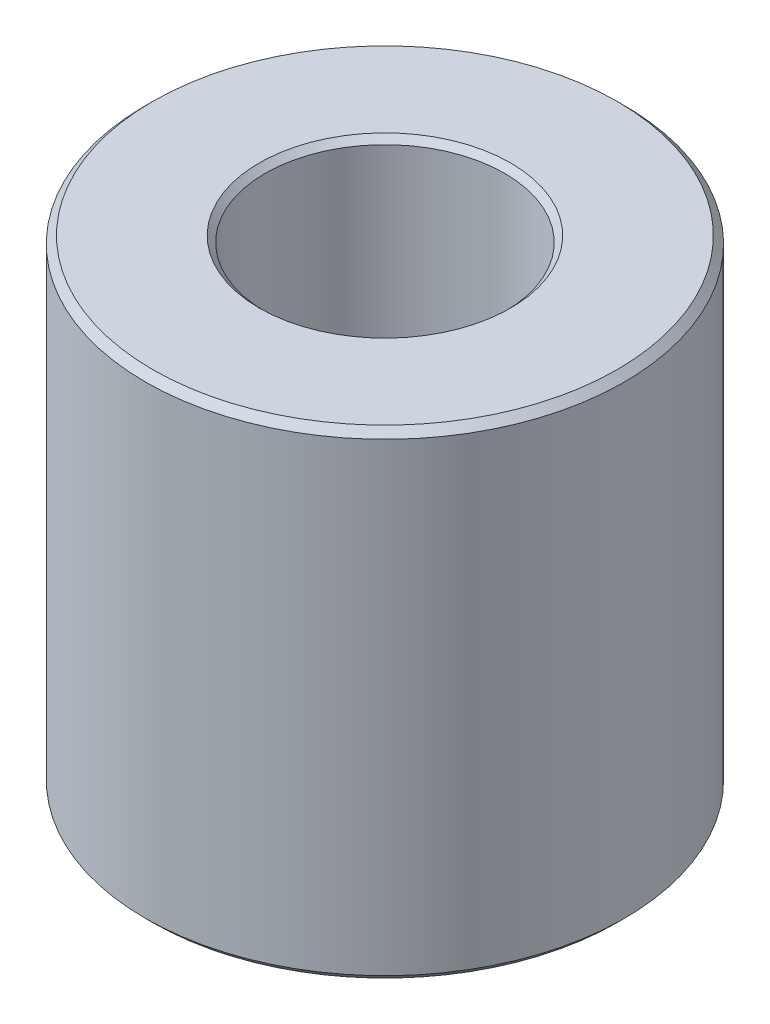
ISO-10303-21;
HEADER;
FILE_DESCRIPTION(('STEP AP214'),'2;1');
FILE_NAME('part.step','',(''),(''),'','','');
FILE_SCHEMA(('AUTOMOTIVE_DESIGN { 1 0 10303 214 1 1 1 1 }'));
ENDSEC;
DATA;
#1=APPLICATION_CONTEXT('core data for automotive mechanical design processes');
#2=APPLICATION_PROTOCOL_DEFINITION('international standard','automotive_design',2000,#1);
#3=PRODUCT_CONTEXT('',#1,'mechanical');
#4=PRODUCT('Part','Part','',(#3));
#5=PRODUCT_RELATED_PRODUCT_CATEGORY('part','',(#4));
#6=PRODUCT_DEFINITION_FORMATION('','',#4);
#7=PRODUCT_DEFINITION_CONTEXT('part definition',#1,'design');
#8=PRODUCT_DEFINITION('design','',#6,#7);
#9=PRODUCT_DEFINITION_SHAPE('','',#8);
#10=(LENGTH_UNIT() NAMED_UNIT(*) SI_UNIT(.MILLI.,.METRE.));
#11=(NAMED_UNIT(*) PLANE_ANGLE_UNIT() SI_UNIT($,.RADIAN.));
#12=(NAMED_UNIT(*) SI_UNIT($,.STERADIAN.) SOLID_ANGLE_UNIT());
#13=UNCERTAINTY_MEASURE_WITH_UNIT(LENGTH_MEASURE(1.E-05),#10,'distance_accuracy_value','');
#14=(GEOMETRIC_REPRESENTATION_CONTEXT(3) GLOBAL_UNCERTAINTY_ASSIGNED_CONTEXT((#13)) GLOBAL_UNIT_ASSIGNED_CONTEXT((#10,
#11,#12)) REPRESENTATION_CONTEXT('',''));
#15=CARTESIAN_POINT('',(0.,0.,0.));
#16=DIRECTION('',(0.,0.,1.));
#17=DIRECTION('',(1.,0.,0.));
#18=AXIS2_PLACEMENT_3D('',#15,#16,#17);
#19=CARTESIAN_POINT('',(0.,50.8,0.));
#20=DIRECTION('',(0.,-1.,0.));
#21=DIRECTION('',(0.,0.,-1.));
#22=AXIS2_PLACEMENT_3D('',#19,#20,#21);
#23=CYLINDRICAL_SURFACE('',#22,25.4);
#24=CARTESIAN_POINT('',(0.,0.761999999999985,0.));
#25=DIRECTION('',(0.,1.,0.));
#26=DIRECTION('',(0.,0.,1.));
#27=AXIS2_PLACEMENT_3D('',#24,#25,#26);
#28=CIRCLE('',#27,25.4);
#29=CARTESIAN_POINT('',(0.,0.761999999999985,25.4));
#30=VERTEX_POINT('',#29);
#31=EDGE_CURVE('E58',#30,#30,#28,.T.);
#32=ORIENTED_EDGE('',*,*,#31,.T.);
#33=EDGE_LOOP('',(#32));
#34=FACE_BOUND('',#33,.T.);
#35=CARTESIAN_POINT('',(0.,50.038,0.));
#36=DIRECTION('',(0.,1.,0.));
#37=DIRECTION('',(0.,0.,1.));
#38=AXIS2_PLACEMENT_3D('',#35,#36,#37);
#39=CIRCLE('',#38,25.4);
#40=CARTESIAN_POINT('',(0.,50.038,25.4));
#41=VERTEX_POINT('',#40);
#42=EDGE_CURVE('E61',#41,#41,#39,.F.);
#43=ORIENTED_EDGE('',*,*,#42,.T.);
#44=EDGE_LOOP('',(#43));
#45=FACE_BOUND('',#44,.T.);
#46=ADVANCED_FACE('F31',(#34,#45),#23,.T.);
#47=CARTESIAN_POINT('',(0.,50.8,0.));
#48=DIRECTION('',(0.,1.,0.));
#49=DIRECTION('',(0.,0.,1.));
#50=AXIS2_PLACEMENT_3D('',#47,#48,#49);
#51=PLANE('',#50);
#52=CARTESIAN_POINT('',(0.,50.8,0.));
#53=DIRECTION('',(0.,1.,0.));
#54=DIRECTION('',(0.,0.,1.));
#55=AXIS2_PLACEMENT_3D('',#52,#53,#54);
#56=CIRCLE('',#55,13.335);
#57=CARTESIAN_POINT('',(0.,50.8,13.335));
#58=VERTEX_POINT('',#57);
#59=EDGE_CURVE('E10',#58,#58,#56,.F.);
#60=ORIENTED_EDGE('',*,*,#59,.T.);
#61=EDGE_LOOP('',(#60));
#62=FACE_BOUND('',#61,.T.);
#63=CARTESIAN_POINT('',(0.,50.8,0.));
#64=DIRECTION('',(0.,1.,0.));
#65=DIRECTION('',(0.,0.,1.));
#66=AXIS2_PLACEMENT_3D('',#63,#64,#65);
#67=CIRCLE('',#66,24.638);
#68=CARTESIAN_POINT('',(0.,50.8,24.638));
#69=VERTEX_POINT('',#68);
#70=EDGE_CURVE('E51',#69,#69,#67,.T.);
#71=ORIENTED_EDGE('',*,*,#70,.T.);
#72=EDGE_LOOP('',(#71));
#73=FACE_BOUND('',#72,.T.);
#74=ADVANCED_FACE('F85',(#62,#73),#51,.T.);
#75=CARTESIAN_POINT('',(0.,0.,0.));
#76=DIRECTION('',(0.,1.,0.));
#77=DIRECTION('',(0.,0.,1.));
#78=AXIS2_PLACEMENT_3D('',#75,#76,#77);
#79=PLANE('',#78);
#80=CARTESIAN_POINT('',(0.,0.,0.));
#81=DIRECTION('',(0.,1.,0.));
#82=DIRECTION('',(0.,0.,1.));
#83=AXIS2_PLACEMENT_3D('',#80,#81,#82);
#84=CIRCLE('',#83,7.12469999999999);
#85=CARTESIAN_POINT('',(0.,0.,7.12469999999999));
#86=VERTEX_POINT('',#85);
#87=EDGE_CURVE('E67',#86,#86,#84,.T.);
#88=ORIENTED_EDGE('',*,*,#87,.T.);
#89=EDGE_LOOP('',(#88));
#90=FACE_BOUND('',#89,.T.);
#91=CARTESIAN_POINT('',(0.,0.,0.));
#92=DIRECTION('',(0.,1.,0.));
#93=DIRECTION('',(0.,0.,1.));
#94=AXIS2_PLACEMENT_3D('',#91,#92,#93);
#95=CIRCLE('',#94,24.638);
#96=CARTESIAN_POINT('',(0.,0.,24.638));
#97=VERTEX_POINT('',#96);
#98=EDGE_CURVE('E55',#97,#97,#95,.F.);
#99=ORIENTED_EDGE('',*,*,#98,.T.);
#100=EDGE_LOOP('',(#99));
#101=FACE_BOUND('',#100,.T.);
#102=ADVANCED_FACE('F73',(#90,#101),#79,.F.);
#103=CARTESIAN_POINT('',(0.,50.8,0.));
#104=DIRECTION('',(0.,1.,0.));
#105=DIRECTION('',(0.,0.,1.));
#106=AXIS2_PLACEMENT_3D('',#103,#104,#105);
#107=CYLINDRICAL_SURFACE('',#106,6.36269999999999);
#108=CARTESIAN_POINT('',(0.,8.382,0.));
#109=DIRECTION('',(0.,-1.,0.));
#110=DIRECTION('',(0.,0.,-1.));
#111=AXIS2_PLACEMENT_3D('',#108,#109,#110);
#112=CIRCLE('',#111,6.36269999999999);
#113=CARTESIAN_POINT('',(0.,8.382,-6.36269999999999));
#114=VERTEX_POINT('',#113);
#115=EDGE_CURVE('E52',#114,#114,#112,.F.);
#116=ORIENTED_EDGE('',*,*,#115,.T.);
#117=EDGE_LOOP('',(#116));
#118=FACE_BOUND('',#117,.T.);
#119=CARTESIAN_POINT('',(0.,0.762000000000013,0.));
#120=DIRECTION('',(0.,1.,0.));
#121=DIRECTION('',(0.,0.,1.));
#122=AXIS2_PLACEMENT_3D('',#119,#120,#121);
#123=CIRCLE('',#122,6.36269999999999);
#124=CARTESIAN_POINT('',(0.,0.762000000000013,6.36269999999999));
#125=VERTEX_POINT('',#124);
#126=EDGE_CURVE('E64',#125,#125,#123,.F.);
#127=ORIENTED_EDGE('',*,*,#126,.T.);
#128=EDGE_LOOP('',(#127));
#129=FACE_BOUND('',#128,.T.);
#130=ADVANCED_FACE('F100',(#118,#129),#107,.F.);
#131=CARTESIAN_POINT('',(0.,0.,0.));
#132=DIRECTION('',(0.,-1.,0.));
#133=DIRECTION('',(0.,0.,-1.));
#134=AXIS2_PLACEMENT_3D('',#131,#132,#133);
#135=CONICAL_SURFACE('',#134,7.12469999999999,0.785398163397439);
#136=ORIENTED_EDGE('',*,*,#126,.F.);
#137=EDGE_LOOP('',(#136));
#138=FACE_BOUND('',#137,.T.);
#139=ORIENTED_EDGE('',*,*,#87,.F.);
#140=EDGE_LOOP('',(#139));
#141=FACE_BOUND('',#140,.T.);
#142=ADVANCED_FACE('F79',(#138,#141),#135,.F.);
#143=CARTESIAN_POINT('',(0.,0.761999999999985,0.));
#144=DIRECTION('',(0.,1.,0.));
#145=DIRECTION('',(0.,0.,1.));
#146=AXIS2_PLACEMENT_3D('',#143,#144,#145);
#147=CONICAL_SURFACE('',#146,25.4,0.785398163397451);
#148=ORIENTED_EDGE('',*,*,#98,.F.);
#149=EDGE_LOOP('',(#148));
#150=FACE_BOUND('',#149,.T.);
#151=ORIENTED_EDGE('',*,*,#31,.F.);
#152=EDGE_LOOP('',(#151));
#153=FACE_BOUND('',#152,.T.);
#154=ADVANCED_FACE('F75',(#150,#153),#147,.T.);
#155=CARTESIAN_POINT('',(0.,50.8,0.));
#156=DIRECTION('',(0.,-1.,0.));
#157=DIRECTION('',(0.,0.,-1.));
#158=AXIS2_PLACEMENT_3D('',#155,#156,#157);
#159=CONICAL_SURFACE('',#158,24.638,0.785398163397453);
#160=ORIENTED_EDGE('',*,*,#42,.F.);
#161=EDGE_LOOP('',(#160));
#162=FACE_BOUND('',#161,.T.);
#163=ORIENTED_EDGE('',*,*,#70,.F.);
#164=EDGE_LOOP('',(#163));
#165=FACE_BOUND('',#164,.T.);
#166=ADVANCED_FACE('F78',(#162,#165),#159,.T.);
#167=CARTESIAN_POINT('',(0.,8.382,0.));
#168=DIRECTION('',(0.,-1.,0.));
#169=DIRECTION('',(0.,0.,-1.));
#170=AXIS2_PLACEMENT_3D('',#167,#168,#169);
#171=PLANE('',#170);
#172=CARTESIAN_POINT('',(0.,8.382,0.));
#173=DIRECTION('',(0.,-1.,0.));
#174=DIRECTION('',(0.,0.,-1.));
#175=AXIS2_PLACEMENT_3D('',#172,#173,#174);
#176=CIRCLE('',#175,12.446);
#177=CARTESIAN_POINT('',(0.,8.382,-12.446));
#178=VERTEX_POINT('',#177);
#179=EDGE_CURVE('E46',#178,#178,#176,.F.);
#180=ORIENTED_EDGE('',*,*,#179,.T.);
#181=EDGE_LOOP('',(#180));
#182=FACE_BOUND('',#181,.T.);
#183=ORIENTED_EDGE('',*,*,#115,.F.);
#184=EDGE_LOOP('',(#183));
#185=FACE_BOUND('',#184,.T.);
#186=ADVANCED_FACE('F91',(#182,#185),#171,.F.);
#187=CARTESIAN_POINT('',(0.,50.8,0.));
#188=DIRECTION('',(0.,1.,0.));
#189=DIRECTION('',(0.,0.,1.));
#190=AXIS2_PLACEMENT_3D('',#187,#188,#189);
#191=CYLINDRICAL_SURFACE('',#190,12.7);
#192=CARTESIAN_POINT('',(0.,50.165,0.));
#193=DIRECTION('',(0.,1.,0.));
#194=DIRECTION('',(0.,0.,1.));
#195=AXIS2_PLACEMENT_3D('',#192,#193,#194);
#196=CIRCLE('',#195,12.7);
#197=CARTESIAN_POINT('',(0.,50.165,12.7));
#198=VERTEX_POINT('',#197);
#199=EDGE_CURVE('E38',#198,#198,#196,.T.);
#200=ORIENTED_EDGE('',*,*,#199,.T.);
#201=EDGE_LOOP('',(#200));
#202=FACE_BOUND('',#201,.T.);
#203=CARTESIAN_POINT('',(0.,8.636,0.));
#204=DIRECTION('',(0.,-1.,0.));
#205=DIRECTION('',(0.,0.,-1.));
#206=AXIS2_PLACEMENT_3D('',#203,#204,#205);
#207=CIRCLE('',#206,12.7);
#208=CARTESIAN_POINT('',(0.,8.636,-12.7));
#209=VERTEX_POINT('',#208);
#210=EDGE_CURVE('E42',#209,#209,#207,.T.);
#211=ORIENTED_EDGE('',*,*,#210,.T.);
#212=EDGE_LOOP('',(#211));
#213=FACE_BOUND('',#212,.T.);
#214=ADVANCED_FACE('F110',(#202,#213),#191,.F.);
#215=CARTESIAN_POINT('',(0.,8.382,0.));
#216=DIRECTION('',(0.,1.,0.));
#217=DIRECTION('',(0.,0.,1.));
#218=AXIS2_PLACEMENT_3D('',#215,#216,#217);
#219=CONICAL_SURFACE('',#218,12.446,0.785398163397455);
#220=ORIENTED_EDGE('',*,*,#210,.F.);
#221=EDGE_LOOP('',(#220));
#222=FACE_BOUND('',#221,.T.);
#223=ORIENTED_EDGE('',*,*,#179,.F.);
#224=EDGE_LOOP('',(#223));
#225=FACE_BOUND('',#224,.T.);
#226=ADVANCED_FACE('F108',(#222,#225),#219,.F.);
#227=CARTESIAN_POINT('',(0.,50.165,0.));
#228=DIRECTION('',(0.,1.,0.));
#229=DIRECTION('',(0.,0.,1.));
#230=AXIS2_PLACEMENT_3D('',#227,#228,#229);
#231=CONICAL_SURFACE('',#230,12.7,0.785398163397446);
#232=ORIENTED_EDGE('',*,*,#59,.F.);
#233=EDGE_LOOP('',(#232));
#234=FACE_BOUND('',#233,.T.);
#235=ORIENTED_EDGE('',*,*,#199,.F.);
#236=EDGE_LOOP('',(#235));
#237=FACE_BOUND('',#236,.T.);
#238=ADVANCED_FACE('F33',(#234,#237),#231,.F.);
#239=CLOSED_SHELL('',(#46,#74,#102,#130,#142,#154,#166,#186,#214,#226,#238));
#240=MANIFOLD_SOLID_BREP('B2',#239);
#241=ADVANCED_BREP_SHAPE_REPRESENTATION('',(#18,#240),#14);
#242=SHAPE_DEFINITION_REPRESENTATION(#9,#241);
ENDSEC;
END-ISO-10303-21;
